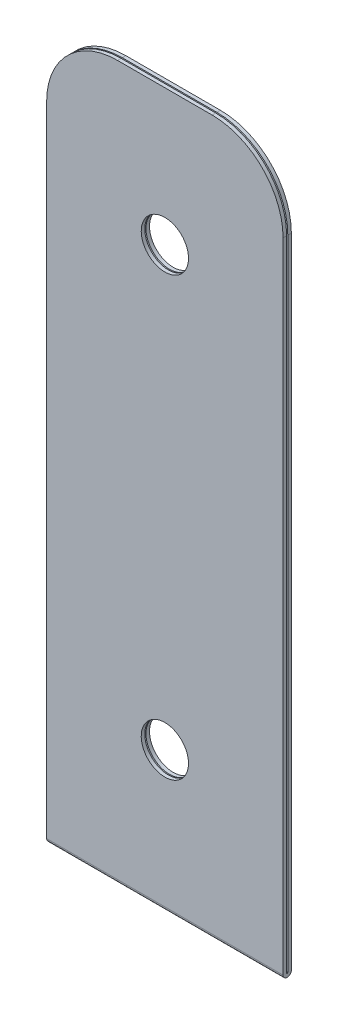
ISO-10303-21;
HEADER;
FILE_DESCRIPTION(('STEP AP214'),'2;1');
FILE_NAME('part.step','',(''),(''),'','','');
FILE_SCHEMA(('AUTOMOTIVE_DESIGN { 1 0 10303 214 1 1 1 1 }'));
ENDSEC;
DATA;
#1=APPLICATION_CONTEXT('core data for automotive mechanical design processes');
#2=APPLICATION_PROTOCOL_DEFINITION('international standard','automotive_design',2000,#1);
#3=PRODUCT_CONTEXT('',#1,'mechanical');
#4=PRODUCT('Part','Part','',(#3));
#5=PRODUCT_RELATED_PRODUCT_CATEGORY('part','',(#4));
#6=PRODUCT_DEFINITION_FORMATION('','',#4);
#7=PRODUCT_DEFINITION_CONTEXT('part definition',#1,'design');
#8=PRODUCT_DEFINITION('design','',#6,#7);
#9=PRODUCT_DEFINITION_SHAPE('','',#8);
#10=(LENGTH_UNIT() NAMED_UNIT(*) SI_UNIT(.MILLI.,.METRE.));
#11=(NAMED_UNIT(*) PLANE_ANGLE_UNIT() SI_UNIT($,.RADIAN.));
#12=(NAMED_UNIT(*) SI_UNIT($,.STERADIAN.) SOLID_ANGLE_UNIT());
#13=UNCERTAINTY_MEASURE_WITH_UNIT(LENGTH_MEASURE(1.E-05),#10,'distance_accuracy_value','');
#14=(GEOMETRIC_REPRESENTATION_CONTEXT(3) GLOBAL_UNCERTAINTY_ASSIGNED_CONTEXT((#13)) GLOBAL_UNIT_ASSIGNED_CONTEXT((#10,
#11,#12)) REPRESENTATION_CONTEXT('',''));
#15=CARTESIAN_POINT('',(0.,0.,0.));
#16=DIRECTION('',(0.,0.,1.));
#17=DIRECTION('',(1.,0.,0.));
#18=AXIS2_PLACEMENT_3D('',#15,#16,#17);
#19=CARTESIAN_POINT('',(10.,30.,0.));
#20=DIRECTION('',(0.,-1.,0.));
#21=DIRECTION('',(0.,0.,-1.));
#22=AXIS2_PLACEMENT_3D('',#19,#20,#21);
#23=PLANE('',#22);
#24=DIRECTION('',(-1.,0.,0.));
#25=VECTOR('',#24,1.);
#26=CARTESIAN_POINT('',(10.,30.,-0.149999999999997));
#27=LINE('',#26,#25);
#28=CARTESIAN_POINT('',(7.,30.,-0.149999999999997));
#29=VERTEX_POINT('',#28);
#30=CARTESIAN_POINT('',(3.,30.,-0.149999999999997));
#31=VERTEX_POINT('',#30);
#32=EDGE_CURVE('E165',#29,#31,#27,.T.);
#33=ORIENTED_EDGE('',*,*,#32,.T.);
#34=DIRECTION('',(0.,0.,1.));
#35=VECTOR('',#34,1.);
#36=CARTESIAN_POINT('',(3.,30.,0.));
#37=LINE('',#36,#35);
#38=CARTESIAN_POINT('',(3.,30.,0.));
#39=VERTEX_POINT('',#38);
#40=EDGE_CURVE('E215',#31,#39,#37,.T.);
#41=ORIENTED_EDGE('',*,*,#40,.T.);
#42=DIRECTION('',(-1.,0.,0.));
#43=VECTOR('',#42,1.);
#44=CARTESIAN_POINT('',(10.,30.,0.));
#45=LINE('',#44,#43);
#46=CARTESIAN_POINT('',(7.,30.,0.));
#47=VERTEX_POINT('',#46);
#48=EDGE_CURVE('E148',#47,#39,#45,.T.);
#49=ORIENTED_EDGE('',*,*,#48,.F.);
#50=DIRECTION('',(0.,0.,1.));
#51=VECTOR('',#50,1.);
#52=CARTESIAN_POINT('',(7.,30.,0.));
#53=LINE('',#52,#51);
#54=EDGE_CURVE('E58',#47,#29,#53,.F.);
#55=ORIENTED_EDGE('',*,*,#54,.T.);
#56=EDGE_LOOP('',(#33,#41,#49,#55));
#57=FACE_BOUND('',#56,.T.);
#58=ADVANCED_FACE('F38',(#57),#23,.F.);
#59=CARTESIAN_POINT('',(10.,30.,0.));
#60=DIRECTION('',(0.,0.,-1.));
#61=DIRECTION('',(0.,1.,0.));
#62=AXIS2_PLACEMENT_3D('',#59,#60,#61);
#63=PLANE('',#62);
#64=CARTESIAN_POINT('',(5.,5.75,0.));
#65=DIRECTION('',(0.,0.,-1.));
#66=DIRECTION('',(0.,1.,0.));
#67=AXIS2_PLACEMENT_3D('',#64,#65,#66);
#68=CIRCLE('',#67,1.);
#69=CARTESIAN_POINT('',(5.,6.75,0.));
#70=VERTEX_POINT('',#69);
#71=EDGE_CURVE('E168',#70,#70,#68,.T.);
#72=ORIENTED_EDGE('',*,*,#71,.T.);
#73=EDGE_LOOP('',(#72));
#74=FACE_BOUND('',#73,.T.);
#75=CARTESIAN_POINT('',(5.,24.25,0.));
#76=DIRECTION('',(0.,0.,-1.));
#77=DIRECTION('',(0.,1.,0.));
#78=AXIS2_PLACEMENT_3D('',#75,#76,#77);
#79=CIRCLE('',#78,1.);
#80=CARTESIAN_POINT('',(5.,25.25,0.));
#81=VERTEX_POINT('',#80);
#82=EDGE_CURVE('E316',#81,#81,#79,.T.);
#83=ORIENTED_EDGE('',*,*,#82,.T.);
#84=EDGE_LOOP('',(#83));
#85=FACE_BOUND('',#84,.T.);
#86=ORIENTED_EDGE('',*,*,#48,.T.);
#87=CARTESIAN_POINT('',(3.,27.,0.));
#88=DIRECTION('',(0.,0.,-1.));
#89=DIRECTION('',(0.,1.,0.));
#90=AXIS2_PLACEMENT_3D('',#87,#88,#89);
#91=CIRCLE('',#90,3.);
#92=CARTESIAN_POINT('',(0.,27.,0.));
#93=VERTEX_POINT('',#92);
#94=EDGE_CURVE('E220',#39,#93,#91,.F.);
#95=ORIENTED_EDGE('',*,*,#94,.T.);
#96=DIRECTION('',(0.,-1.,0.));
#97=VECTOR('',#96,1.);
#98=CARTESIAN_POINT('',(0.,30.,0.));
#99=LINE('',#98,#97);
#100=CARTESIAN_POINT('',(0.,0.,0.));
#101=VERTEX_POINT('',#100);
#102=EDGE_CURVE('E145',#93,#101,#99,.T.);
#103=ORIENTED_EDGE('',*,*,#102,.T.);
#104=DIRECTION('',(-1.,0.,0.));
#105=VECTOR('',#104,1.);
#106=CARTESIAN_POINT('',(10.,0.,0.));
#107=LINE('',#106,#105);
#108=CARTESIAN_POINT('',(10.,0.,0.));
#109=VERTEX_POINT('',#108);
#110=EDGE_CURVE('E141',#109,#101,#107,.T.);
#111=ORIENTED_EDGE('',*,*,#110,.F.);
#112=DIRECTION('',(0.,-1.,0.));
#113=VECTOR('',#112,1.);
#114=CARTESIAN_POINT('',(10.,30.,0.));
#115=LINE('',#114,#113);
#116=CARTESIAN_POINT('',(10.,27.,0.));
#117=VERTEX_POINT('',#116);
#118=EDGE_CURVE('E127',#117,#109,#115,.T.);
#119=ORIENTED_EDGE('',*,*,#118,.F.);
#120=CARTESIAN_POINT('',(7.,27.,0.));
#121=DIRECTION('',(0.,0.,-1.));
#122=DIRECTION('',(0.,1.,0.));
#123=AXIS2_PLACEMENT_3D('',#120,#121,#122);
#124=CIRCLE('',#123,3.);
#125=EDGE_CURVE('E218',#117,#47,#124,.F.);
#126=ORIENTED_EDGE('',*,*,#125,.T.);
#127=EDGE_LOOP('',(#86,#95,#103,#111,#119,#126));
#128=FACE_BOUND('',#127,.T.);
#129=ADVANCED_FACE('F143',(#74,#85,#128),#63,.F.);
#130=CARTESIAN_POINT('',(10.,0.,0.0249999999999999));
#131=DIRECTION('',(-1.,0.,0.));
#132=DIRECTION('',(0.,0.,1.));
#133=AXIS2_PLACEMENT_3D('',#130,#131,#132);
#134=CYLINDRICAL_SURFACE('',#133,0.0249999999999999);
#135=CARTESIAN_POINT('',(0.,0.,0.0249999999999999));
#136=DIRECTION('',(-1.,0.,0.));
#137=DIRECTION('',(0.,0.,1.));
#138=AXIS2_PLACEMENT_3D('',#135,#136,#137);
#139=CIRCLE('',#138,0.0249999999999999);
#140=CARTESIAN_POINT('',(0.,0.,0.0499999999999998));
#141=VERTEX_POINT('',#140);
#142=EDGE_CURVE('E167',#101,#141,#139,.T.);
#143=ORIENTED_EDGE('',*,*,#142,.T.);
#144=DIRECTION('',(-1.,0.,0.));
#145=VECTOR('',#144,1.);
#146=CARTESIAN_POINT('',(10.,0.,0.0499999999999998));
#147=LINE('',#146,#145);
#148=CARTESIAN_POINT('',(10.,0.,0.0499999999999998));
#149=VERTEX_POINT('',#148);
#150=EDGE_CURVE('E149',#149,#141,#147,.T.);
#151=ORIENTED_EDGE('',*,*,#150,.F.);
#152=CARTESIAN_POINT('',(10.,0.,0.0249999999999999));
#153=DIRECTION('',(-1.,0.,0.));
#154=DIRECTION('',(0.,0.,1.));
#155=AXIS2_PLACEMENT_3D('',#152,#153,#154);
#156=CIRCLE('',#155,0.0249999999999999);
#157=EDGE_CURVE('E132',#109,#149,#156,.T.);
#158=ORIENTED_EDGE('',*,*,#157,.F.);
#159=ORIENTED_EDGE('',*,*,#110,.T.);
#160=EDGE_LOOP('',(#143,#151,#158,#159));
#161=FACE_BOUND('',#160,.T.);
#162=ADVANCED_FACE('F151',(#161),#134,.F.);
#163=CARTESIAN_POINT('',(10.,30.,0.0500000000000035));
#164=DIRECTION('',(0.,0.,1.));
#165=DIRECTION('',(0.,-1.,0.));
#166=AXIS2_PLACEMENT_3D('',#163,#164,#165);
#167=PLANE('',#166);
#168=CARTESIAN_POINT('',(5.,5.75,0.0500000000000005));
#169=DIRECTION('',(0.,0.,1.));
#170=DIRECTION('',(0.,-1.,0.));
#171=AXIS2_PLACEMENT_3D('',#168,#169,#170);
#172=CIRCLE('',#171,1.);
#173=CARTESIAN_POINT('',(5.,4.75,0.0500000000000004));
#174=VERTEX_POINT('',#173);
#175=EDGE_CURVE('E327',#174,#174,#172,.T.);
#176=ORIENTED_EDGE('',*,*,#175,.T.);
#177=EDGE_LOOP('',(#176));
#178=FACE_BOUND('',#177,.T.);
#179=CARTESIAN_POINT('',(5.,24.25,0.0500000000000028));
#180=DIRECTION('',(0.,0.,1.));
#181=DIRECTION('',(0.,-1.,0.));
#182=AXIS2_PLACEMENT_3D('',#179,#180,#181);
#183=CIRCLE('',#182,1.);
#184=CARTESIAN_POINT('',(5.,23.25,0.0500000000000027));
#185=VERTEX_POINT('',#184);
#186=EDGE_CURVE('E314',#185,#185,#183,.T.);
#187=ORIENTED_EDGE('',*,*,#186,.T.);
#188=EDGE_LOOP('',(#187));
#189=FACE_BOUND('',#188,.T.);
#190=DIRECTION('',(0.,1.,0.));
#191=VECTOR('',#190,1.);
#192=CARTESIAN_POINT('',(0.,30.,0.0500000000000035));
#193=LINE('',#192,#191);
#194=CARTESIAN_POINT('',(0.,27.,0.0500000000000031));
#195=VERTEX_POINT('',#194);
#196=EDGE_CURVE('E170',#141,#195,#193,.T.);
#197=ORIENTED_EDGE('',*,*,#196,.T.);
#198=CARTESIAN_POINT('',(3.,27.,0.0500000000000031));
#199=DIRECTION('',(0.,0.,1.));
#200=DIRECTION('',(0.,-1.,0.));
#201=AXIS2_PLACEMENT_3D('',#198,#199,#200);
#202=CIRCLE('',#201,3.);
#203=CARTESIAN_POINT('',(3.,30.,0.0500000000000035));
#204=VERTEX_POINT('',#203);
#205=EDGE_CURVE('E208',#195,#204,#202,.F.);
#206=ORIENTED_EDGE('',*,*,#205,.T.);
#207=DIRECTION('',(-1.,0.,0.));
#208=VECTOR('',#207,1.);
#209=CARTESIAN_POINT('',(10.,30.,0.0500000000000035));
#210=LINE('',#209,#208);
#211=CARTESIAN_POINT('',(7.,30.,0.0500000000000035));
#212=VERTEX_POINT('',#211);
#213=EDGE_CURVE('E188',#212,#204,#210,.T.);
#214=ORIENTED_EDGE('',*,*,#213,.F.);
#215=CARTESIAN_POINT('',(7.,27.,0.0500000000000031));
#216=DIRECTION('',(0.,0.,1.));
#217=DIRECTION('',(0.,-1.,0.));
#218=AXIS2_PLACEMENT_3D('',#215,#216,#217);
#219=CIRCLE('',#218,3.);
#220=CARTESIAN_POINT('',(10.,27.,0.0500000000000031));
#221=VERTEX_POINT('',#220);
#222=EDGE_CURVE('E206',#212,#221,#219,.F.);
#223=ORIENTED_EDGE('',*,*,#222,.T.);
#224=DIRECTION('',(0.,1.,0.));
#225=VECTOR('',#224,1.);
#226=CARTESIAN_POINT('',(10.,30.,0.0500000000000035));
#227=LINE('',#226,#225);
#228=EDGE_CURVE('E154',#149,#221,#227,.T.);
#229=ORIENTED_EDGE('',*,*,#228,.F.);
#230=ORIENTED_EDGE('',*,*,#150,.T.);
#231=EDGE_LOOP('',(#197,#206,#214,#223,#229,#230));
#232=FACE_BOUND('',#231,.T.);
#233=ADVANCED_FACE('F237',(#178,#189,#232),#167,.F.);
#234=CARTESIAN_POINT('',(10.,30.,0.0500000000000035));
#235=DIRECTION('',(0.,-1.,0.));
#236=DIRECTION('',(0.,0.,-1.));
#237=AXIS2_PLACEMENT_3D('',#234,#235,#236);
#238=PLANE('',#237);
#239=ORIENTED_EDGE('',*,*,#213,.T.);
#240=DIRECTION('',(0.,0.,1.));
#241=VECTOR('',#240,1.);
#242=CARTESIAN_POINT('',(3.,30.,0.200000000000003));
#243=LINE('',#242,#241);
#244=CARTESIAN_POINT('',(3.,30.,0.200000000000003));
#245=VERTEX_POINT('',#244);
#246=EDGE_CURVE('E195',#204,#245,#243,.T.);
#247=ORIENTED_EDGE('',*,*,#246,.T.);
#248=DIRECTION('',(-1.,0.,0.));
#249=VECTOR('',#248,1.);
#250=CARTESIAN_POINT('',(10.,30.,0.200000000000003));
#251=LINE('',#250,#249);
#252=CARTESIAN_POINT('',(7.,30.,0.200000000000003));
#253=VERTEX_POINT('',#252);
#254=EDGE_CURVE('E185',#253,#245,#251,.T.);
#255=ORIENTED_EDGE('',*,*,#254,.F.);
#256=DIRECTION('',(0.,0.,1.));
#257=VECTOR('',#256,1.);
#258=CARTESIAN_POINT('',(7.,30.,0.0500000000000035));
#259=LINE('',#258,#257);
#260=EDGE_CURVE('E193',#253,#212,#259,.F.);
#261=ORIENTED_EDGE('',*,*,#260,.T.);
#262=EDGE_LOOP('',(#239,#247,#255,#261));
#263=FACE_BOUND('',#262,.T.);
#264=ADVANCED_FACE('F251',(#263),#238,.F.);
#265=CARTESIAN_POINT('',(10.,30.,0.200000000000003));
#266=DIRECTION('',(0.,0.,-1.));
#267=DIRECTION('',(0.,1.,0.));
#268=AXIS2_PLACEMENT_3D('',#265,#266,#267);
#269=PLANE('',#268);
#270=CARTESIAN_POINT('',(5.,5.75,0.2));
#271=DIRECTION('',(0.,0.,-1.));
#272=DIRECTION('',(0.,1.,0.));
#273=AXIS2_PLACEMENT_3D('',#270,#271,#272);
#274=CIRCLE('',#273,1.);
#275=CARTESIAN_POINT('',(5.,6.75,0.200000000000001));
#276=VERTEX_POINT('',#275);
#277=EDGE_CURVE('E319',#276,#276,#274,.T.);
#278=ORIENTED_EDGE('',*,*,#277,.T.);
#279=EDGE_LOOP('',(#278));
#280=FACE_BOUND('',#279,.T.);
#281=CARTESIAN_POINT('',(5.,24.25,0.200000000000003));
#282=DIRECTION('',(0.,0.,-1.));
#283=DIRECTION('',(0.,1.,0.));
#284=AXIS2_PLACEMENT_3D('',#281,#282,#283);
#285=CIRCLE('',#284,1.);
#286=CARTESIAN_POINT('',(5.,25.25,0.200000000000003));
#287=VERTEX_POINT('',#286);
#288=EDGE_CURVE('E311',#287,#287,#285,.T.);
#289=ORIENTED_EDGE('',*,*,#288,.T.);
#290=EDGE_LOOP('',(#289));
#291=FACE_BOUND('',#290,.T.);
#292=ORIENTED_EDGE('',*,*,#254,.T.);
#293=CARTESIAN_POINT('',(3.,27.,0.200000000000003));
#294=DIRECTION('',(0.,0.,-1.));
#295=DIRECTION('',(0.,1.,0.));
#296=AXIS2_PLACEMENT_3D('',#293,#294,#295);
#297=CIRCLE('',#296,3.);
#298=CARTESIAN_POINT('',(0.,27.,0.200000000000003));
#299=VERTEX_POINT('',#298);
#300=EDGE_CURVE('E200',#245,#299,#297,.F.);
#301=ORIENTED_EDGE('',*,*,#300,.T.);
#302=DIRECTION('',(0.,-1.,0.));
#303=VECTOR('',#302,1.);
#304=CARTESIAN_POINT('',(0.,30.,0.200000000000003));
#305=LINE('',#304,#303);
#306=CARTESIAN_POINT('',(0.,0.,0.2));
#307=VERTEX_POINT('',#306);
#308=EDGE_CURVE('E173',#299,#307,#305,.T.);
#309=ORIENTED_EDGE('',*,*,#308,.T.);
#310=DIRECTION('',(-1.,0.,0.));
#311=VECTOR('',#310,1.);
#312=CARTESIAN_POINT('',(10.,0.,0.2));
#313=LINE('',#312,#311);
#314=CARTESIAN_POINT('',(10.,0.,0.2));
#315=VERTEX_POINT('',#314);
#316=EDGE_CURVE('E182',#315,#307,#313,.T.);
#317=ORIENTED_EDGE('',*,*,#316,.F.);
#318=DIRECTION('',(0.,-1.,0.));
#319=VECTOR('',#318,1.);
#320=CARTESIAN_POINT('',(10.,30.,0.200000000000003));
#321=LINE('',#320,#319);
#322=CARTESIAN_POINT('',(10.,27.,0.200000000000003));
#323=VERTEX_POINT('',#322);
#324=EDGE_CURVE('E156',#323,#315,#321,.T.);
#325=ORIENTED_EDGE('',*,*,#324,.F.);
#326=CARTESIAN_POINT('',(7.,27.,0.200000000000003));
#327=DIRECTION('',(0.,0.,-1.));
#328=DIRECTION('',(0.,1.,0.));
#329=AXIS2_PLACEMENT_3D('',#326,#327,#328);
#330=CIRCLE('',#329,3.);
#331=EDGE_CURVE('E198',#323,#253,#330,.F.);
#332=ORIENTED_EDGE('',*,*,#331,.T.);
#333=EDGE_LOOP('',(#292,#301,#309,#317,#325,#332));
#334=FACE_BOUND('',#333,.T.);
#335=ADVANCED_FACE('F248',(#280,#291,#334),#269,.F.);
#336=CARTESIAN_POINT('',(10.,0.,0.0249999999999999));
#337=DIRECTION('',(-1.,0.,0.));
#338=DIRECTION('',(0.,0.,1.));
#339=AXIS2_PLACEMENT_3D('',#336,#337,#338);
#340=CYLINDRICAL_SURFACE('',#339,0.175);
#341=CARTESIAN_POINT('',(0.,0.,0.0249999999999999));
#342=DIRECTION('',(1.,0.,0.));
#343=DIRECTION('',(0.,0.,1.));
#344=AXIS2_PLACEMENT_3D('',#341,#342,#343);
#345=CIRCLE('',#344,0.175);
#346=CARTESIAN_POINT('',(0.,0.,-0.15));
#347=VERTEX_POINT('',#346);
#348=EDGE_CURVE('E175',#307,#347,#345,.T.);
#349=ORIENTED_EDGE('',*,*,#348,.T.);
#350=DIRECTION('',(-1.,0.,0.));
#351=VECTOR('',#350,1.);
#352=CARTESIAN_POINT('',(10.,0.,-0.15));
#353=LINE('',#352,#351);
#354=CARTESIAN_POINT('',(10.,0.,-0.15));
#355=VERTEX_POINT('',#354);
#356=EDGE_CURVE('E179',#355,#347,#353,.T.);
#357=ORIENTED_EDGE('',*,*,#356,.F.);
#358=CARTESIAN_POINT('',(10.,0.,0.0249999999999999));
#359=DIRECTION('',(1.,0.,0.));
#360=DIRECTION('',(0.,0.,1.));
#361=AXIS2_PLACEMENT_3D('',#358,#359,#360);
#362=CIRCLE('',#361,0.175);
#363=EDGE_CURVE('E161',#315,#355,#362,.T.);
#364=ORIENTED_EDGE('',*,*,#363,.F.);
#365=ORIENTED_EDGE('',*,*,#316,.T.);
#366=EDGE_LOOP('',(#349,#357,#364,#365));
#367=FACE_BOUND('',#366,.T.);
#368=ADVANCED_FACE('F258',(#367),#340,.T.);
#369=CARTESIAN_POINT('',(10.,30.,-0.149999999999997));
#370=DIRECTION('',(0.,0.,1.));
#371=DIRECTION('',(0.,-1.,0.));
#372=AXIS2_PLACEMENT_3D('',#369,#370,#371);
#373=PLANE('',#372);
#374=CARTESIAN_POINT('',(5.,5.75,-0.15));
#375=DIRECTION('',(0.,0.,1.));
#376=DIRECTION('',(1.,0.,0.));
#377=AXIS2_PLACEMENT_3D('',#374,#375,#376);
#378=CIRCLE('',#377,1.);
#379=CARTESIAN_POINT('',(6.,5.75,-0.15));
#380=VERTEX_POINT('',#379);
#381=EDGE_CURVE('E321',#380,#380,#378,.T.);
#382=ORIENTED_EDGE('',*,*,#381,.T.);
#383=EDGE_LOOP('',(#382));
#384=FACE_BOUND('',#383,.T.);
#385=CARTESIAN_POINT('',(5.,24.25,-0.15));
#386=DIRECTION('',(0.,0.,1.));
#387=DIRECTION('',(1.,0.,0.));
#388=AXIS2_PLACEMENT_3D('',#385,#386,#387);
#389=CIRCLE('',#388,1.);
#390=CARTESIAN_POINT('',(6.,24.25,-0.15));
#391=VERTEX_POINT('',#390);
#392=EDGE_CURVE('E443',#391,#391,#389,.T.);
#393=ORIENTED_EDGE('',*,*,#392,.T.);
#394=EDGE_LOOP('',(#393));
#395=FACE_BOUND('',#394,.T.);
#396=DIRECTION('',(0.,1.,0.));
#397=VECTOR('',#396,1.);
#398=CARTESIAN_POINT('',(0.,30.,-0.149999999999997));
#399=LINE('',#398,#397);
#400=CARTESIAN_POINT('',(0.,27.,-0.149999999999997));
#401=VERTEX_POINT('',#400);
#402=EDGE_CURVE('E138',#347,#401,#399,.T.);
#403=ORIENTED_EDGE('',*,*,#402,.T.);
#404=CARTESIAN_POINT('',(3.,27.,-0.149999999999997));
#405=DIRECTION('',(0.,0.,1.));
#406=DIRECTION('',(0.,-1.,0.));
#407=AXIS2_PLACEMENT_3D('',#404,#405,#406);
#408=CIRCLE('',#407,3.);
#409=EDGE_CURVE('E11',#401,#31,#408,.F.);
#410=ORIENTED_EDGE('',*,*,#409,.T.);
#411=ORIENTED_EDGE('',*,*,#32,.F.);
#412=CARTESIAN_POINT('',(7.,27.,-0.149999999999997));
#413=DIRECTION('',(0.,0.,1.));
#414=DIRECTION('',(0.,-1.,0.));
#415=AXIS2_PLACEMENT_3D('',#412,#413,#414);
#416=CIRCLE('',#415,3.);
#417=CARTESIAN_POINT('',(10.,27.,-0.149999999999997));
#418=VERTEX_POINT('',#417);
#419=EDGE_CURVE('E46',#29,#418,#416,.F.);
#420=ORIENTED_EDGE('',*,*,#419,.T.);
#421=DIRECTION('',(0.,1.,0.));
#422=VECTOR('',#421,1.);
#423=CARTESIAN_POINT('',(10.,30.,-0.149999999999997));
#424=LINE('',#423,#422);
#425=EDGE_CURVE('E163',#355,#418,#424,.T.);
#426=ORIENTED_EDGE('',*,*,#425,.F.);
#427=ORIENTED_EDGE('',*,*,#356,.T.);
#428=EDGE_LOOP('',(#403,#410,#411,#420,#426,#427));
#429=FACE_BOUND('',#428,.T.);
#430=ADVANCED_FACE('F223',(#384,#395,#429),#373,.F.);
#431=CARTESIAN_POINT('',(10.,0.,0.0249999999999999));
#432=DIRECTION('',(-1.,0.,0.));
#433=DIRECTION('',(0.,0.,1.));
#434=AXIS2_PLACEMENT_3D('',#431,#432,#433);
#435=PLANE('',#434);
#436=ORIENTED_EDGE('',*,*,#228,.T.);
#437=DIRECTION('',(0.,0.,1.));
#438=VECTOR('',#437,1.);
#439=CARTESIAN_POINT('',(10.,27.,0.0249999999999999));
#440=LINE('',#439,#438);
#441=EDGE_CURVE('E211',#221,#323,#440,.T.);
#442=ORIENTED_EDGE('',*,*,#441,.T.);
#443=ORIENTED_EDGE('',*,*,#324,.T.);
#444=ORIENTED_EDGE('',*,*,#363,.T.);
#445=ORIENTED_EDGE('',*,*,#425,.T.);
#446=DIRECTION('',(0.,0.,1.));
#447=VECTOR('',#446,1.);
#448=CARTESIAN_POINT('',(10.,27.,0.0249999999999999));
#449=LINE('',#448,#447);
#450=EDGE_CURVE('E136',#418,#117,#449,.T.);
#451=ORIENTED_EDGE('',*,*,#450,.T.);
#452=ORIENTED_EDGE('',*,*,#118,.T.);
#453=ORIENTED_EDGE('',*,*,#157,.T.);
#454=EDGE_LOOP('',(#436,#442,#443,#444,#445,#451,#452,#453));
#455=FACE_BOUND('',#454,.T.);
#456=ADVANCED_FACE('F130',(#455),#435,.F.);
#457=CARTESIAN_POINT('',(0.,0.,0.0249999999999999));
#458=DIRECTION('',(-1.,0.,0.));
#459=DIRECTION('',(0.,0.,1.));
#460=AXIS2_PLACEMENT_3D('',#457,#458,#459);
#461=PLANE('',#460);
#462=ORIENTED_EDGE('',*,*,#308,.F.);
#463=DIRECTION('',(0.,0.,1.));
#464=VECTOR('',#463,1.);
#465=CARTESIAN_POINT('',(0.,27.,0.0500000000000035));
#466=LINE('',#465,#464);
#467=EDGE_CURVE('E204',#299,#195,#466,.F.);
#468=ORIENTED_EDGE('',*,*,#467,.T.);
#469=ORIENTED_EDGE('',*,*,#196,.F.);
#470=ORIENTED_EDGE('',*,*,#142,.F.);
#471=ORIENTED_EDGE('',*,*,#102,.F.);
#472=DIRECTION('',(0.,0.,1.));
#473=VECTOR('',#472,1.);
#474=CARTESIAN_POINT('',(0.,27.,-0.149999999999997));
#475=LINE('',#474,#473);
#476=EDGE_CURVE('E202',#93,#401,#475,.F.);
#477=ORIENTED_EDGE('',*,*,#476,.T.);
#478=ORIENTED_EDGE('',*,*,#402,.F.);
#479=ORIENTED_EDGE('',*,*,#348,.F.);
#480=EDGE_LOOP('',(#462,#468,#469,#470,#471,#477,#478,#479));
#481=FACE_BOUND('',#480,.T.);
#482=ADVANCED_FACE('F233',(#481),#461,.T.);
#483=CARTESIAN_POINT('',(3.,27.,0.0500000000000035));
#484=DIRECTION('',(0.,0.,-1.));
#485=DIRECTION('',(-1.,0.,0.));
#486=AXIS2_PLACEMENT_3D('',#483,#484,#485);
#487=CYLINDRICAL_SURFACE('',#486,3.);
#488=ORIENTED_EDGE('',*,*,#205,.F.);
#489=ORIENTED_EDGE('',*,*,#467,.F.);
#490=ORIENTED_EDGE('',*,*,#300,.F.);
#491=ORIENTED_EDGE('',*,*,#246,.F.);
#492=EDGE_LOOP('',(#488,#489,#490,#491));
#493=FACE_BOUND('',#492,.T.);
#494=ADVANCED_FACE('F254',(#493),#487,.T.);
#495=CARTESIAN_POINT('',(7.,27.,0.0249999999999999));
#496=DIRECTION('',(0.,0.,1.));
#497=DIRECTION('',(1.,0.,0.));
#498=AXIS2_PLACEMENT_3D('',#495,#496,#497);
#499=CYLINDRICAL_SURFACE('',#498,3.);
#500=ORIENTED_EDGE('',*,*,#222,.F.);
#501=ORIENTED_EDGE('',*,*,#260,.F.);
#502=ORIENTED_EDGE('',*,*,#331,.F.);
#503=ORIENTED_EDGE('',*,*,#441,.F.);
#504=EDGE_LOOP('',(#500,#501,#502,#503));
#505=FACE_BOUND('',#504,.T.);
#506=ADVANCED_FACE('F244',(#505),#499,.T.);
#507=CARTESIAN_POINT('',(3.,27.,0.));
#508=DIRECTION('',(0.,0.,-1.));
#509=DIRECTION('',(-1.,0.,0.));
#510=AXIS2_PLACEMENT_3D('',#507,#508,#509);
#511=CYLINDRICAL_SURFACE('',#510,3.);
#512=ORIENTED_EDGE('',*,*,#409,.F.);
#513=ORIENTED_EDGE('',*,*,#476,.F.);
#514=ORIENTED_EDGE('',*,*,#94,.F.);
#515=ORIENTED_EDGE('',*,*,#40,.F.);
#516=EDGE_LOOP('',(#512,#513,#514,#515));
#517=FACE_BOUND('',#516,.T.);
#518=ADVANCED_FACE('F229',(#517),#511,.T.);
#519=CARTESIAN_POINT('',(7.,27.,0.0249999999999999));
#520=DIRECTION('',(0.,0.,1.));
#521=DIRECTION('',(1.,0.,0.));
#522=AXIS2_PLACEMENT_3D('',#519,#520,#521);
#523=CYLINDRICAL_SURFACE('',#522,3.);
#524=ORIENTED_EDGE('',*,*,#419,.F.);
#525=ORIENTED_EDGE('',*,*,#54,.F.);
#526=ORIENTED_EDGE('',*,*,#125,.F.);
#527=ORIENTED_EDGE('',*,*,#450,.F.);
#528=EDGE_LOOP('',(#524,#525,#526,#527));
#529=FACE_BOUND('',#528,.T.);
#530=ADVANCED_FACE('F40',(#529),#523,.T.);
#531=CARTESIAN_POINT('',(5.,24.25,-0.15));
#532=DIRECTION('',(0.,0.,1.));
#533=DIRECTION('',(1.,0.,0.));
#534=AXIS2_PLACEMENT_3D('',#531,#532,#533);
#535=CYLINDRICAL_SURFACE('',#534,1.);
#536=ORIENTED_EDGE('',*,*,#392,.F.);
#537=EDGE_LOOP('',(#536));
#538=FACE_BOUND('',#537,.T.);
#539=ORIENTED_EDGE('',*,*,#82,.F.);
#540=EDGE_LOOP('',(#539));
#541=FACE_BOUND('',#540,.T.);
#542=ADVANCED_FACE('F285',(#538,#541),#535,.F.);
#543=CARTESIAN_POINT('',(5.,5.75,-0.15));
#544=DIRECTION('',(0.,0.,1.));
#545=DIRECTION('',(1.,0.,0.));
#546=AXIS2_PLACEMENT_3D('',#543,#544,#545);
#547=CYLINDRICAL_SURFACE('',#546,1.);
#548=ORIENTED_EDGE('',*,*,#381,.F.);
#549=EDGE_LOOP('',(#548));
#550=FACE_BOUND('',#549,.T.);
#551=ORIENTED_EDGE('',*,*,#71,.F.);
#552=EDGE_LOOP('',(#551));
#553=FACE_BOUND('',#552,.T.);
#554=ADVANCED_FACE('F289',(#550,#553),#547,.F.);
#555=ORIENTED_EDGE('',*,*,#288,.F.);
#556=EDGE_LOOP('',(#555));
#557=FACE_BOUND('',#556,.T.);
#558=ORIENTED_EDGE('',*,*,#186,.F.);
#559=EDGE_LOOP('',(#558));
#560=FACE_BOUND('',#559,.T.);
#561=ADVANCED_FACE('F292',(#557,#560),#535,.F.);
#562=ORIENTED_EDGE('',*,*,#277,.F.);
#563=EDGE_LOOP('',(#562));
#564=FACE_BOUND('',#563,.T.);
#565=ORIENTED_EDGE('',*,*,#175,.F.);
#566=EDGE_LOOP('',(#565));
#567=FACE_BOUND('',#566,.T.);
#568=ADVANCED_FACE('F298',(#564,#567),#547,.F.);
#569=CLOSED_SHELL('',(#58,#129,#162,#233,#264,#335,#368,#430,#456,#482,#494,#506,#518,#530,#542,
#554,#561,#568));
#570=MANIFOLD_SOLID_BREP('B2',#569);
#571=ADVANCED_BREP_SHAPE_REPRESENTATION('',(#18,#570),#14);
#572=SHAPE_DEFINITION_REPRESENTATION(#9,#571);
ENDSEC;
END-ISO-10303-21;
